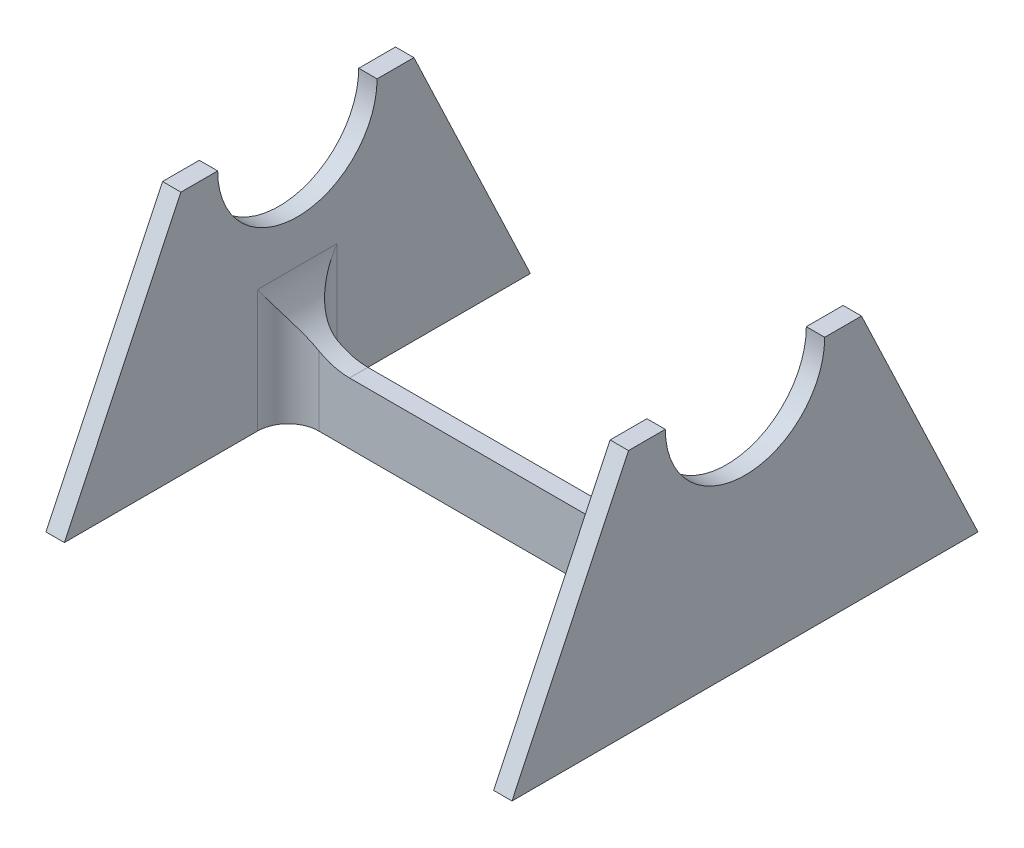
ISO-10303-21;
HEADER;
FILE_DESCRIPTION(('STEP AP214'),'2;1');
FILE_NAME('part.step','',(''),(''),'','','');
FILE_SCHEMA(('AUTOMOTIVE_DESIGN { 1 0 10303 214 1 1 1 1 }'));
ENDSEC;
DATA;
#1=APPLICATION_CONTEXT('core data for automotive mechanical design processes');
#2=APPLICATION_PROTOCOL_DEFINITION('international standard','automotive_design',2000,#1);
#3=PRODUCT_CONTEXT('',#1,'mechanical');
#4=PRODUCT('Part','Part','',(#3));
#5=PRODUCT_RELATED_PRODUCT_CATEGORY('part','',(#4));
#6=PRODUCT_DEFINITION_FORMATION('','',#4);
#7=PRODUCT_DEFINITION_CONTEXT('part definition',#1,'design');
#8=PRODUCT_DEFINITION('design','',#6,#7);
#9=PRODUCT_DEFINITION_SHAPE('','',#8);
#10=(LENGTH_UNIT() NAMED_UNIT(*) SI_UNIT(.MILLI.,.METRE.));
#11=(NAMED_UNIT(*) PLANE_ANGLE_UNIT() SI_UNIT($,.RADIAN.));
#12=(NAMED_UNIT(*) SI_UNIT($,.STERADIAN.) SOLID_ANGLE_UNIT());
#13=UNCERTAINTY_MEASURE_WITH_UNIT(LENGTH_MEASURE(1.E-05),#10,'distance_accuracy_value','');
#14=(GEOMETRIC_REPRESENTATION_CONTEXT(3) GLOBAL_UNCERTAINTY_ASSIGNED_CONTEXT((#13)) GLOBAL_UNIT_ASSIGNED_CONTEXT((#10,
#11,#12)) REPRESENTATION_CONTEXT('',''));
#15=CARTESIAN_POINT('',(0.,0.,0.));
#16=DIRECTION('',(0.,0.,1.));
#17=DIRECTION('',(1.,0.,0.));
#18=AXIS2_PLACEMENT_3D('',#15,#16,#17);
#19=CARTESIAN_POINT('',(-35.,-20.,3.));
#20=DIRECTION('',(0.,1.,0.));
#21=DIRECTION('',(0.,0.,1.));
#22=AXIS2_PLACEMENT_3D('',#19,#20,#21);
#23=PLANE('',#22);
#24=DIRECTION('',(0.,0.,-1.));
#25=VECTOR('',#24,1.);
#26=CARTESIAN_POINT('',(-35.,-20.,39.5));
#27=LINE('',#26,#25);
#28=CARTESIAN_POINT('',(-35.,-20.,-4.99999999999998));
#29=VERTEX_POINT('',#28);
#30=CARTESIAN_POINT('',(-35.,-20.,-36.5));
#31=VERTEX_POINT('',#30);
#32=EDGE_CURVE('E229',#29,#31,#27,.T.);
#33=ORIENTED_EDGE('',*,*,#32,.F.);
#34=CARTESIAN_POINT('',(-30.,-20.,-5.));
#35=DIRECTION('',(0.,1.,0.));
#36=DIRECTION('',(0.,0.,1.));
#37=AXIS2_PLACEMENT_3D('',#34,#35,#36);
#38=CIRCLE('',#37,5.);
#39=CARTESIAN_POINT('',(-30.,-20.,0.));
#40=VERTEX_POINT('',#39);
#41=EDGE_CURVE('E353',#29,#40,#38,.T.);
#42=ORIENTED_EDGE('',*,*,#41,.T.);
#43=DIRECTION('',(1.,0.,0.));
#44=VECTOR('',#43,1.);
#45=CARTESIAN_POINT('',(-35.,-20.,0.));
#46=LINE('',#45,#44);
#47=CARTESIAN_POINT('',(30.,-20.,0.));
#48=VERTEX_POINT('',#47);
#49=EDGE_CURVE('E284',#40,#48,#46,.T.);
#50=ORIENTED_EDGE('',*,*,#49,.T.);
#51=CARTESIAN_POINT('',(30.,-20.,-5.));
#52=DIRECTION('',(0.,1.,0.));
#53=DIRECTION('',(0.,0.,1.));
#54=AXIS2_PLACEMENT_3D('',#51,#52,#53);
#55=CIRCLE('',#54,5.);
#56=CARTESIAN_POINT('',(35.,-20.,-5.00000000000001));
#57=VERTEX_POINT('',#56);
#58=EDGE_CURVE('E316',#48,#57,#55,.T.);
#59=ORIENTED_EDGE('',*,*,#58,.T.);
#60=DIRECTION('',(0.,0.,-1.));
#61=VECTOR('',#60,1.);
#62=CARTESIAN_POINT('',(35.,-20.,-36.5));
#63=LINE('',#62,#61);
#64=CARTESIAN_POINT('',(35.,-20.,-36.5));
#65=VERTEX_POINT('',#64);
#66=EDGE_CURVE('E264',#57,#65,#63,.T.);
#67=ORIENTED_EDGE('',*,*,#66,.T.);
#68=DIRECTION('',(-1.,0.,0.));
#69=VECTOR('',#68,1.);
#70=CARTESIAN_POINT('',(38.,-20.,-36.5));
#71=LINE('',#70,#69);
#72=CARTESIAN_POINT('',(38.,-20.,-36.5));
#73=VERTEX_POINT('',#72);
#74=EDGE_CURVE('E683',#73,#65,#71,.T.);
#75=ORIENTED_EDGE('',*,*,#74,.F.);
#76=DIRECTION('',(0.,0.,-1.));
#77=VECTOR('',#76,1.);
#78=CARTESIAN_POINT('',(38.,-20.,39.5));
#79=LINE('',#78,#77);
#80=CARTESIAN_POINT('',(38.,-20.,39.5));
#81=VERTEX_POINT('',#80);
#82=EDGE_CURVE('E250',#81,#73,#79,.T.);
#83=ORIENTED_EDGE('',*,*,#82,.F.);
#84=DIRECTION('',(-1.,0.,0.));
#85=VECTOR('',#84,1.);
#86=CARTESIAN_POINT('',(38.,-20.,39.5));
#87=LINE('',#86,#85);
#88=CARTESIAN_POINT('',(35.,-20.,39.5));
#89=VERTEX_POINT('',#88);
#90=EDGE_CURVE('E677',#81,#89,#87,.T.);
#91=ORIENTED_EDGE('',*,*,#90,.T.);
#92=CARTESIAN_POINT('',(35.,-20.,7.99999999999999));
#93=VERTEX_POINT('',#92);
#94=EDGE_CURVE('E274',#89,#93,#63,.T.);
#95=ORIENTED_EDGE('',*,*,#94,.T.);
#96=CARTESIAN_POINT('',(30.,-20.,8.));
#97=DIRECTION('',(0.,1.,0.));
#98=DIRECTION('',(0.,0.,1.));
#99=AXIS2_PLACEMENT_3D('',#96,#97,#98);
#100=CIRCLE('',#99,5.);
#101=CARTESIAN_POINT('',(30.,-20.,3.));
#102=VERTEX_POINT('',#101);
#103=EDGE_CURVE('E11',#93,#102,#100,.T.);
#104=ORIENTED_EDGE('',*,*,#103,.T.);
#105=DIRECTION('',(1.,0.,0.));
#106=VECTOR('',#105,1.);
#107=CARTESIAN_POINT('',(-35.,-20.,3.));
#108=LINE('',#107,#106);
#109=CARTESIAN_POINT('',(-30.,-20.,3.));
#110=VERTEX_POINT('',#109);
#111=EDGE_CURVE('E259',#110,#102,#108,.T.);
#112=ORIENTED_EDGE('',*,*,#111,.F.);
#113=CARTESIAN_POINT('',(-30.,-20.,8.));
#114=DIRECTION('',(0.,1.,0.));
#115=DIRECTION('',(0.,0.,1.));
#116=AXIS2_PLACEMENT_3D('',#113,#114,#115);
#117=CIRCLE('',#116,5.);
#118=CARTESIAN_POINT('',(-35.,-20.,8.00000000000001));
#119=VERTEX_POINT('',#118);
#120=EDGE_CURVE('E55',#110,#119,#117,.T.);
#121=ORIENTED_EDGE('',*,*,#120,.T.);
#122=CARTESIAN_POINT('',(-35.,-20.,39.5));
#123=VERTEX_POINT('',#122);
#124=EDGE_CURVE('E239',#123,#119,#27,.T.);
#125=ORIENTED_EDGE('',*,*,#124,.F.);
#126=DIRECTION('',(1.,0.,0.));
#127=VECTOR('',#126,1.);
#128=CARTESIAN_POINT('',(-38.,-20.,39.5));
#129=LINE('',#128,#127);
#130=CARTESIAN_POINT('',(-38.,-20.,39.5));
#131=VERTEX_POINT('',#130);
#132=EDGE_CURVE('E397',#131,#123,#129,.T.);
#133=ORIENTED_EDGE('',*,*,#132,.F.);
#134=DIRECTION('',(0.,0.,-1.));
#135=VECTOR('',#134,1.);
#136=CARTESIAN_POINT('',(-38.,-20.,-36.5));
#137=LINE('',#136,#135);
#138=CARTESIAN_POINT('',(-38.,-20.,-36.5));
#139=VERTEX_POINT('',#138);
#140=EDGE_CURVE('E212',#131,#139,#137,.T.);
#141=ORIENTED_EDGE('',*,*,#140,.T.);
#142=DIRECTION('',(1.,0.,0.));
#143=VECTOR('',#142,1.);
#144=CARTESIAN_POINT('',(-38.,-20.,-36.5));
#145=LINE('',#144,#143);
#146=EDGE_CURVE('E399',#139,#31,#145,.T.);
#147=ORIENTED_EDGE('',*,*,#146,.T.);
#148=EDGE_LOOP('',(#33,#42,#50,#59,#67,#75,#83,#91,#95,#104,#112,#121,#125,#133,#141,#147));
#149=FACE_BOUND('',#148,.T.);
#150=ADVANCED_FACE('F33',(#149),#23,.F.);
#151=CARTESIAN_POINT('',(0.,0.,3.));
#152=DIRECTION('',(0.,0.,-1.));
#153=DIRECTION('',(-1.,0.,0.));
#154=AXIS2_PLACEMENT_3D('',#151,#152,#153);
#155=PLANE('',#154);
#156=CARTESIAN_POINT('',(-25.,0.,3.));
#157=DIRECTION('',(0.,0.,-1.));
#158=DIRECTION('',(-1.,0.,0.));
#159=AXIS2_PLACEMENT_3D('',#156,#157,#158);
#160=CIRCLE('',#159,10.);
#161=CARTESIAN_POINT('',(-25.,-9.99999999999999,3.));
#162=VERTEX_POINT('',#161);
#163=CARTESIAN_POINT('',(-30.,-8.66025403784438,3.));
#164=VERTEX_POINT('',#163);
#165=EDGE_CURVE('E377',#162,#164,#160,.T.);
#166=ORIENTED_EDGE('',*,*,#165,.T.);
#167=DIRECTION('',(0.,-1.,0.));
#168=VECTOR('',#167,1.);
#169=CARTESIAN_POINT('',(-30.,-20.,3.));
#170=LINE('',#169,#168);
#171=EDGE_CURVE('E307',#164,#110,#170,.T.);
#172=ORIENTED_EDGE('',*,*,#171,.T.);
#173=ORIENTED_EDGE('',*,*,#111,.T.);
#174=DIRECTION('',(0.,1.,0.));
#175=VECTOR('',#174,1.);
#176=CARTESIAN_POINT('',(30.,0.,3.));
#177=LINE('',#176,#175);
#178=CARTESIAN_POINT('',(30.,-8.66025403784439,3.));
#179=VERTEX_POINT('',#178);
#180=EDGE_CURVE('E301',#102,#179,#177,.T.);
#181=ORIENTED_EDGE('',*,*,#180,.T.);
#182=CARTESIAN_POINT('',(25.,0.,3.));
#183=DIRECTION('',(0.,0.,-1.));
#184=DIRECTION('',(-1.,0.,0.));
#185=AXIS2_PLACEMENT_3D('',#182,#183,#184);
#186=CIRCLE('',#185,10.);
#187=CARTESIAN_POINT('',(25.,-10.,3.));
#188=VERTEX_POINT('',#187);
#189=EDGE_CURVE('E370',#179,#188,#186,.T.);
#190=ORIENTED_EDGE('',*,*,#189,.T.);
#191=DIRECTION('',(1.,0.,0.));
#192=VECTOR('',#191,1.);
#193=CARTESIAN_POINT('',(-35.,-9.99999999999999,3.));
#194=LINE('',#193,#192);
#195=EDGE_CURVE('E421',#162,#188,#194,.T.);
#196=ORIENTED_EDGE('',*,*,#195,.F.);
#197=EDGE_LOOP('',(#166,#172,#173,#181,#190,#196));
#198=FACE_BOUND('',#197,.T.);
#199=ADVANCED_FACE('F420',(#198),#155,.F.);
#200=CARTESIAN_POINT('',(0.,0.,0.));
#201=DIRECTION('',(0.,0.,-1.));
#202=DIRECTION('',(-1.,0.,0.));
#203=AXIS2_PLACEMENT_3D('',#200,#201,#202);
#204=PLANE('',#203);
#205=CARTESIAN_POINT('',(25.,0.,0.));
#206=DIRECTION('',(0.,0.,-1.));
#207=DIRECTION('',(-1.,0.,0.));
#208=AXIS2_PLACEMENT_3D('',#205,#206,#207);
#209=CIRCLE('',#208,10.);
#210=CARTESIAN_POINT('',(25.,-10.,0.));
#211=VERTEX_POINT('',#210);
#212=CARTESIAN_POINT('',(30.,-8.66025403784439,0.));
#213=VERTEX_POINT('',#212);
#214=EDGE_CURVE('E368',#211,#213,#209,.F.);
#215=ORIENTED_EDGE('',*,*,#214,.T.);
#216=DIRECTION('',(0.,1.,0.));
#217=VECTOR('',#216,1.);
#218=CARTESIAN_POINT('',(30.,0.,0.));
#219=LINE('',#218,#217);
#220=EDGE_CURVE('E290',#213,#48,#219,.F.);
#221=ORIENTED_EDGE('',*,*,#220,.T.);
#222=ORIENTED_EDGE('',*,*,#49,.F.);
#223=DIRECTION('',(0.,-1.,0.));
#224=VECTOR('',#223,1.);
#225=CARTESIAN_POINT('',(-30.,0.,0.));
#226=LINE('',#225,#224);
#227=CARTESIAN_POINT('',(-30.,-8.66025403784438,0.));
#228=VERTEX_POINT('',#227);
#229=EDGE_CURVE('E289',#40,#228,#226,.F.);
#230=ORIENTED_EDGE('',*,*,#229,.T.);
#231=CARTESIAN_POINT('',(-25.,0.,0.));
#232=DIRECTION('',(0.,0.,-1.));
#233=DIRECTION('',(-1.,0.,0.));
#234=AXIS2_PLACEMENT_3D('',#231,#232,#233);
#235=CIRCLE('',#234,10.);
#236=CARTESIAN_POINT('',(-25.,-9.99999999999999,0.));
#237=VERTEX_POINT('',#236);
#238=EDGE_CURVE('E373',#228,#237,#235,.F.);
#239=ORIENTED_EDGE('',*,*,#238,.T.);
#240=DIRECTION('',(1.,0.,0.));
#241=VECTOR('',#240,1.);
#242=CARTESIAN_POINT('',(-35.,-9.99999999999999,0.));
#243=LINE('',#242,#241);
#244=EDGE_CURVE('E226',#237,#211,#243,.T.);
#245=ORIENTED_EDGE('',*,*,#244,.T.);
#246=EDGE_LOOP('',(#215,#221,#222,#230,#239,#245));
#247=FACE_BOUND('',#246,.T.);
#248=ADVANCED_FACE('F424',(#247),#204,.T.);
#249=CARTESIAN_POINT('',(35.,20.,1.5));
#250=DIRECTION('',(1.,0.,0.));
#251=DIRECTION('',(0.,0.,-1.));
#252=AXIS2_PLACEMENT_3D('',#249,#250,#251);
#253=PLANE('',#252);
#254=ORIENTED_EDGE('',*,*,#66,.F.);
#255=DIRECTION('',(0.,1.,0.));
#256=VECTOR('',#255,1.);
#257=CARTESIAN_POINT('',(35.,20.,-5.));
#258=LINE('',#257,#256);
#259=CARTESIAN_POINT('',(35.,0.,-5.));
#260=VERTEX_POINT('',#259);
#261=EDGE_CURVE('E288',#57,#260,#258,.T.);
#262=ORIENTED_EDGE('',*,*,#261,.T.);
#263=DIRECTION('',(0.,0.,1.));
#264=VECTOR('',#263,1.);
#265=CARTESIAN_POINT('',(35.,0.,3.));
#266=LINE('',#265,#264);
#267=CARTESIAN_POINT('',(35.,0.,8.));
#268=VERTEX_POINT('',#267);
#269=EDGE_CURVE('E380',#260,#268,#266,.T.);
#270=ORIENTED_EDGE('',*,*,#269,.T.);
#271=DIRECTION('',(0.,1.,0.));
#272=VECTOR('',#271,1.);
#273=CARTESIAN_POINT('',(35.,-20.,8.));
#274=LINE('',#273,#272);
#275=EDGE_CURVE('E367',#268,#93,#274,.F.);
#276=ORIENTED_EDGE('',*,*,#275,.T.);
#277=ORIENTED_EDGE('',*,*,#94,.F.);
#278=DIRECTION('',(0.,-0.90327750435429,0.429056814568288));
#279=VECTOR('',#278,1.);
#280=CARTESIAN_POINT('',(35.,20.,20.5));
#281=LINE('',#280,#279);
#282=CARTESIAN_POINT('',(35.,20.,20.5));
#283=VERTEX_POINT('',#282);
#284=EDGE_CURVE('E261',#283,#89,#281,.T.);
#285=ORIENTED_EDGE('',*,*,#284,.F.);
#286=DIRECTION('',(0.,0.,1.));
#287=VECTOR('',#286,1.);
#288=CARTESIAN_POINT('',(35.,20.,14.5));
#289=LINE('',#288,#287);
#290=CARTESIAN_POINT('',(35.,20.,14.5));
#291=VERTEX_POINT('',#290);
#292=EDGE_CURVE('E194',#291,#283,#289,.T.);
#293=ORIENTED_EDGE('',*,*,#292,.F.);
#294=CARTESIAN_POINT('',(35.,20.,1.5));
#295=DIRECTION('',(-1.,0.,0.));
#296=DIRECTION('',(0.,0.,1.));
#297=AXIS2_PLACEMENT_3D('',#294,#295,#296);
#298=CIRCLE('',#297,13.);
#299=CARTESIAN_POINT('',(35.,20.,-11.5));
#300=VERTEX_POINT('',#299);
#301=EDGE_CURVE('E257',#300,#291,#298,.T.);
#302=ORIENTED_EDGE('',*,*,#301,.F.);
#303=DIRECTION('',(0.,0.,1.));
#304=VECTOR('',#303,1.);
#305=CARTESIAN_POINT('',(35.,20.,-11.5));
#306=LINE('',#305,#304);
#307=CARTESIAN_POINT('',(35.,20.,-17.5));
#308=VERTEX_POINT('',#307);
#309=EDGE_CURVE('E246',#308,#300,#306,.T.);
#310=ORIENTED_EDGE('',*,*,#309,.F.);
#311=DIRECTION('',(0.,0.90327750435429,0.429056814568288));
#312=VECTOR('',#311,1.);
#313=CARTESIAN_POINT('',(35.,20.,-17.5));
#314=LINE('',#313,#312);
#315=EDGE_CURVE('E267',#65,#308,#314,.T.);
#316=ORIENTED_EDGE('',*,*,#315,.F.);
#317=EDGE_LOOP('',(#254,#262,#270,#276,#277,#285,#293,#302,#310,#316));
#318=FACE_BOUND('',#317,.T.);
#319=ADVANCED_FACE('F364',(#318),#253,.F.);
#320=CARTESIAN_POINT('',(38.,20.,1.5));
#321=DIRECTION('',(-1.,0.,0.));
#322=DIRECTION('',(0.,0.,1.));
#323=AXIS2_PLACEMENT_3D('',#320,#321,#322);
#324=CYLINDRICAL_SURFACE('',#323,13.);
#325=DIRECTION('',(-1.,0.,0.));
#326=VECTOR('',#325,1.);
#327=CARTESIAN_POINT('',(38.,20.,-11.5));
#328=LINE('',#327,#326);
#329=CARTESIAN_POINT('',(38.,20.,-11.5));
#330=VERTEX_POINT('',#329);
#331=EDGE_CURVE('E256',#330,#300,#328,.T.);
#332=ORIENTED_EDGE('',*,*,#331,.T.);
#333=ORIENTED_EDGE('',*,*,#301,.T.);
#334=DIRECTION('',(-1.,0.,0.));
#335=VECTOR('',#334,1.);
#336=CARTESIAN_POINT('',(38.,20.,14.5));
#337=LINE('',#336,#335);
#338=CARTESIAN_POINT('',(38.,20.,14.5));
#339=VERTEX_POINT('',#338);
#340=EDGE_CURVE('E277',#339,#291,#337,.T.);
#341=ORIENTED_EDGE('',*,*,#340,.F.);
#342=CARTESIAN_POINT('',(38.,20.,1.5));
#343=DIRECTION('',(-1.,0.,0.));
#344=DIRECTION('',(0.,0.,-1.));
#345=AXIS2_PLACEMENT_3D('',#342,#343,#344);
#346=CIRCLE('',#345,13.);
#347=EDGE_CURVE('E243',#330,#339,#346,.T.);
#348=ORIENTED_EDGE('',*,*,#347,.F.);
#349=EDGE_LOOP('',(#332,#333,#341,#348));
#350=FACE_BOUND('',#349,.T.);
#351=ADVANCED_FACE('F438',(#350),#324,.F.);
#352=CARTESIAN_POINT('',(38.,20.,14.5));
#353=DIRECTION('',(0.,-1.,0.));
#354=DIRECTION('',(0.,0.,-1.));
#355=AXIS2_PLACEMENT_3D('',#352,#353,#354);
#356=PLANE('',#355);
#357=ORIENTED_EDGE('',*,*,#292,.T.);
#358=DIRECTION('',(-1.,0.,0.));
#359=VECTOR('',#358,1.);
#360=CARTESIAN_POINT('',(38.,20.,20.5));
#361=LINE('',#360,#359);
#362=CARTESIAN_POINT('',(38.,20.,20.5));
#363=VERTEX_POINT('',#362);
#364=EDGE_CURVE('E673',#363,#283,#361,.T.);
#365=ORIENTED_EDGE('',*,*,#364,.F.);
#366=DIRECTION('',(0.,0.,1.));
#367=VECTOR('',#366,1.);
#368=CARTESIAN_POINT('',(38.,20.,14.5));
#369=LINE('',#368,#367);
#370=EDGE_CURVE('E245',#339,#363,#369,.T.);
#371=ORIENTED_EDGE('',*,*,#370,.F.);
#372=ORIENTED_EDGE('',*,*,#340,.T.);
#373=EDGE_LOOP('',(#357,#365,#371,#372));
#374=FACE_BOUND('',#373,.T.);
#375=ADVANCED_FACE('F441',(#374),#356,.F.);
#376=CARTESIAN_POINT('',(38.,20.,20.5));
#377=DIRECTION('',(0.,-0.429056814568288,-0.90327750435429));
#378=DIRECTION('',(0.,0.90327750435429,-0.429056814568288));
#379=AXIS2_PLACEMENT_3D('',#376,#377,#378);
#380=PLANE('',#379);
#381=ORIENTED_EDGE('',*,*,#284,.T.);
#382=ORIENTED_EDGE('',*,*,#90,.F.);
#383=DIRECTION('',(0.,-0.90327750435429,0.429056814568288));
#384=VECTOR('',#383,1.);
#385=CARTESIAN_POINT('',(38.,20.,20.5));
#386=LINE('',#385,#384);
#387=EDGE_CURVE('E248',#363,#81,#386,.T.);
#388=ORIENTED_EDGE('',*,*,#387,.F.);
#389=ORIENTED_EDGE('',*,*,#364,.T.);
#390=EDGE_LOOP('',(#381,#382,#388,#389));
#391=FACE_BOUND('',#390,.T.);
#392=ADVANCED_FACE('F445',(#391),#380,.F.);
#393=CARTESIAN_POINT('',(38.,20.,-17.5));
#394=DIRECTION('',(0.,-0.429056814568288,0.90327750435429));
#395=DIRECTION('',(0.,-0.90327750435429,-0.429056814568288));
#396=AXIS2_PLACEMENT_3D('',#393,#394,#395);
#397=PLANE('',#396);
#398=ORIENTED_EDGE('',*,*,#315,.T.);
#399=DIRECTION('',(-1.,0.,0.));
#400=VECTOR('',#399,1.);
#401=CARTESIAN_POINT('',(38.,20.,-17.5));
#402=LINE('',#401,#400);
#403=CARTESIAN_POINT('',(38.,20.,-17.5));
#404=VERTEX_POINT('',#403);
#405=EDGE_CURVE('E684',#404,#308,#402,.T.);
#406=ORIENTED_EDGE('',*,*,#405,.F.);
#407=DIRECTION('',(0.,0.90327750435429,0.429056814568288));
#408=VECTOR('',#407,1.);
#409=CARTESIAN_POINT('',(38.,20.,-17.5));
#410=LINE('',#409,#408);
#411=EDGE_CURVE('E252',#73,#404,#410,.T.);
#412=ORIENTED_EDGE('',*,*,#411,.F.);
#413=ORIENTED_EDGE('',*,*,#74,.T.);
#414=EDGE_LOOP('',(#398,#406,#412,#413));
#415=FACE_BOUND('',#414,.T.);
#416=ADVANCED_FACE('F449',(#415),#397,.F.);
#417=CARTESIAN_POINT('',(38.,20.,-11.5));
#418=DIRECTION('',(0.,-1.,0.));
#419=DIRECTION('',(0.,0.,-1.));
#420=AXIS2_PLACEMENT_3D('',#417,#418,#419);
#421=PLANE('',#420);
#422=ORIENTED_EDGE('',*,*,#309,.T.);
#423=ORIENTED_EDGE('',*,*,#331,.F.);
#424=DIRECTION('',(0.,0.,1.));
#425=VECTOR('',#424,1.);
#426=CARTESIAN_POINT('',(38.,20.,-11.5));
#427=LINE('',#426,#425);
#428=EDGE_CURVE('E254',#404,#330,#427,.T.);
#429=ORIENTED_EDGE('',*,*,#428,.F.);
#430=ORIENTED_EDGE('',*,*,#405,.T.);
#431=EDGE_LOOP('',(#422,#423,#429,#430));
#432=FACE_BOUND('',#431,.T.);
#433=ADVANCED_FACE('F453',(#432),#421,.F.);
#434=CARTESIAN_POINT('',(38.,20.,1.5));
#435=DIRECTION('',(1.,0.,0.));
#436=DIRECTION('',(0.,0.,-1.));
#437=AXIS2_PLACEMENT_3D('',#434,#435,#436);
#438=PLANE('',#437);
#439=ORIENTED_EDGE('',*,*,#347,.T.);
#440=ORIENTED_EDGE('',*,*,#370,.T.);
#441=ORIENTED_EDGE('',*,*,#387,.T.);
#442=ORIENTED_EDGE('',*,*,#82,.T.);
#443=ORIENTED_EDGE('',*,*,#411,.T.);
#444=ORIENTED_EDGE('',*,*,#428,.T.);
#445=EDGE_LOOP('',(#439,#440,#441,#442,#443,#444));
#446=FACE_BOUND('',#445,.T.);
#447=ADVANCED_FACE('F457',(#446),#438,.T.);
#448=CARTESIAN_POINT('',(-35.,20.,1.5));
#449=DIRECTION('',(-1.,0.,0.));
#450=DIRECTION('',(0.,0.,-1.));
#451=AXIS2_PLACEMENT_3D('',#448,#449,#450);
#452=PLANE('',#451);
#453=DIRECTION('',(0.,0.,1.));
#454=VECTOR('',#453,1.);
#455=CARTESIAN_POINT('',(-35.,0.,0.));
#456=LINE('',#455,#454);
#457=CARTESIAN_POINT('',(-35.,0.,8.));
#458=VERTEX_POINT('',#457);
#459=CARTESIAN_POINT('',(-35.,0.,-5.));
#460=VERTEX_POINT('',#459);
#461=EDGE_CURVE('E382',#458,#460,#456,.F.);
#462=ORIENTED_EDGE('',*,*,#461,.T.);
#463=DIRECTION('',(0.,-1.,0.));
#464=VECTOR('',#463,1.);
#465=CARTESIAN_POINT('',(-35.,20.,-5.));
#466=LINE('',#465,#464);
#467=EDGE_CURVE('E297',#460,#29,#466,.T.);
#468=ORIENTED_EDGE('',*,*,#467,.T.);
#469=ORIENTED_EDGE('',*,*,#32,.T.);
#470=DIRECTION('',(0.,0.90327750435429,0.429056814568288));
#471=VECTOR('',#470,1.);
#472=CARTESIAN_POINT('',(-35.,20.,-17.5));
#473=LINE('',#472,#471);
#474=CARTESIAN_POINT('',(-35.,20.,-17.5));
#475=VERTEX_POINT('',#474);
#476=EDGE_CURVE('E225',#31,#475,#473,.T.);
#477=ORIENTED_EDGE('',*,*,#476,.T.);
#478=DIRECTION('',(0.,0.,1.));
#479=VECTOR('',#478,1.);
#480=CARTESIAN_POINT('',(-35.,20.,-11.5));
#481=LINE('',#480,#479);
#482=CARTESIAN_POINT('',(-35.,20.,-11.5));
#483=VERTEX_POINT('',#482);
#484=EDGE_CURVE('E223',#475,#483,#481,.T.);
#485=ORIENTED_EDGE('',*,*,#484,.T.);
#486=CARTESIAN_POINT('',(-35.,20.,1.5));
#487=DIRECTION('',(-1.,0.,0.));
#488=DIRECTION('',(0.,0.,1.));
#489=AXIS2_PLACEMENT_3D('',#486,#487,#488);
#490=CIRCLE('',#489,13.);
#491=CARTESIAN_POINT('',(-35.,20.,14.5));
#492=VERTEX_POINT('',#491);
#493=EDGE_CURVE('E189',#483,#492,#490,.T.);
#494=ORIENTED_EDGE('',*,*,#493,.T.);
#495=DIRECTION('',(0.,0.,1.));
#496=VECTOR('',#495,1.);
#497=CARTESIAN_POINT('',(-35.,20.,14.5));
#498=LINE('',#497,#496);
#499=CARTESIAN_POINT('',(-35.,20.,20.5));
#500=VERTEX_POINT('',#499);
#501=EDGE_CURVE('E207',#492,#500,#498,.T.);
#502=ORIENTED_EDGE('',*,*,#501,.T.);
#503=DIRECTION('',(0.,-0.90327750435429,0.429056814568288));
#504=VECTOR('',#503,1.);
#505=CARTESIAN_POINT('',(-35.,20.,20.5));
#506=LINE('',#505,#504);
#507=EDGE_CURVE('E232',#500,#123,#506,.T.);
#508=ORIENTED_EDGE('',*,*,#507,.T.);
#509=ORIENTED_EDGE('',*,*,#124,.T.);
#510=DIRECTION('',(0.,-1.,0.));
#511=VECTOR('',#510,1.);
#512=CARTESIAN_POINT('',(-35.,0.,8.));
#513=LINE('',#512,#511);
#514=EDGE_CURVE('E291',#119,#458,#513,.F.);
#515=ORIENTED_EDGE('',*,*,#514,.T.);
#516=EDGE_LOOP('',(#462,#468,#469,#477,#485,#494,#502,#508,#509,#515));
#517=FACE_BOUND('',#516,.T.);
#518=ADVANCED_FACE('F404',(#517),#452,.F.);
#519=CARTESIAN_POINT('',(-38.,20.,-11.5));
#520=DIRECTION('',(0.,1.,0.));
#521=DIRECTION('',(0.,0.,1.));
#522=AXIS2_PLACEMENT_3D('',#519,#520,#521);
#523=PLANE('',#522);
#524=ORIENTED_EDGE('',*,*,#484,.F.);
#525=DIRECTION('',(1.,0.,0.));
#526=VECTOR('',#525,1.);
#527=CARTESIAN_POINT('',(-38.,20.,-17.5));
#528=LINE('',#527,#526);
#529=CARTESIAN_POINT('',(-38.,20.,-17.5));
#530=VERTEX_POINT('',#529);
#531=EDGE_CURVE('E195',#530,#475,#528,.T.);
#532=ORIENTED_EDGE('',*,*,#531,.F.);
#533=DIRECTION('',(0.,0.,1.));
#534=VECTOR('',#533,1.);
#535=CARTESIAN_POINT('',(-38.,20.,-11.5));
#536=LINE('',#535,#534);
#537=CARTESIAN_POINT('',(-38.,20.,-11.5));
#538=VERTEX_POINT('',#537);
#539=EDGE_CURVE('E202',#530,#538,#536,.T.);
#540=ORIENTED_EDGE('',*,*,#539,.T.);
#541=DIRECTION('',(1.,0.,0.));
#542=VECTOR('',#541,1.);
#543=CARTESIAN_POINT('',(-38.,20.,-11.5));
#544=LINE('',#543,#542);
#545=EDGE_CURVE('E183',#538,#483,#544,.T.);
#546=ORIENTED_EDGE('',*,*,#545,.T.);
#547=EDGE_LOOP('',(#524,#532,#540,#546));
#548=FACE_BOUND('',#547,.T.);
#549=ADVANCED_FACE('F209',(#548),#523,.T.);
#550=CARTESIAN_POINT('',(-38.,20.,-17.5));
#551=DIRECTION('',(0.,0.429056814568288,-0.90327750435429));
#552=DIRECTION('',(0.,0.90327750435429,0.429056814568288));
#553=AXIS2_PLACEMENT_3D('',#550,#551,#552);
#554=PLANE('',#553);
#555=ORIENTED_EDGE('',*,*,#476,.F.);
#556=ORIENTED_EDGE('',*,*,#146,.F.);
#557=DIRECTION('',(0.,0.90327750435429,0.429056814568288));
#558=VECTOR('',#557,1.);
#559=CARTESIAN_POINT('',(-38.,20.,-17.5));
#560=LINE('',#559,#558);
#561=EDGE_CURVE('E210',#139,#530,#560,.T.);
#562=ORIENTED_EDGE('',*,*,#561,.T.);
#563=ORIENTED_EDGE('',*,*,#531,.T.);
#564=EDGE_LOOP('',(#555,#556,#562,#563));
#565=FACE_BOUND('',#564,.T.);
#566=ADVANCED_FACE('F403',(#565),#554,.T.);
#567=CARTESIAN_POINT('',(-38.,20.,20.5));
#568=DIRECTION('',(0.,0.429056814568288,0.90327750435429));
#569=DIRECTION('',(0.,-0.90327750435429,0.429056814568288));
#570=AXIS2_PLACEMENT_3D('',#567,#568,#569);
#571=PLANE('',#570);
#572=ORIENTED_EDGE('',*,*,#507,.F.);
#573=DIRECTION('',(1.,0.,0.));
#574=VECTOR('',#573,1.);
#575=CARTESIAN_POINT('',(-38.,20.,20.5));
#576=LINE('',#575,#574);
#577=CARTESIAN_POINT('',(-38.,20.,20.5));
#578=VERTEX_POINT('',#577);
#579=EDGE_CURVE('E395',#578,#500,#576,.T.);
#580=ORIENTED_EDGE('',*,*,#579,.F.);
#581=DIRECTION('',(0.,-0.90327750435429,0.429056814568288));
#582=VECTOR('',#581,1.);
#583=CARTESIAN_POINT('',(-38.,20.,20.5));
#584=LINE('',#583,#582);
#585=EDGE_CURVE('E218',#578,#131,#584,.T.);
#586=ORIENTED_EDGE('',*,*,#585,.T.);
#587=ORIENTED_EDGE('',*,*,#132,.T.);
#588=EDGE_LOOP('',(#572,#580,#586,#587));
#589=FACE_BOUND('',#588,.T.);
#590=ADVANCED_FACE('F411',(#589),#571,.T.);
#591=CARTESIAN_POINT('',(-38.,20.,14.5));
#592=DIRECTION('',(0.,1.,0.));
#593=DIRECTION('',(0.,0.,1.));
#594=AXIS2_PLACEMENT_3D('',#591,#592,#593);
#595=PLANE('',#594);
#596=ORIENTED_EDGE('',*,*,#501,.F.);
#597=DIRECTION('',(1.,0.,0.));
#598=VECTOR('',#597,1.);
#599=CARTESIAN_POINT('',(-38.,20.,14.5));
#600=LINE('',#599,#598);
#601=CARTESIAN_POINT('',(-38.,20.,14.5));
#602=VERTEX_POINT('',#601);
#603=EDGE_CURVE('E222',#602,#492,#600,.T.);
#604=ORIENTED_EDGE('',*,*,#603,.F.);
#605=DIRECTION('',(0.,0.,1.));
#606=VECTOR('',#605,1.);
#607=CARTESIAN_POINT('',(-38.,20.,14.5));
#608=LINE('',#607,#606);
#609=EDGE_CURVE('E206',#602,#578,#608,.T.);
#610=ORIENTED_EDGE('',*,*,#609,.T.);
#611=ORIENTED_EDGE('',*,*,#579,.T.);
#612=EDGE_LOOP('',(#596,#604,#610,#611));
#613=FACE_BOUND('',#612,.T.);
#614=ADVANCED_FACE('F414',(#613),#595,.T.);
#615=CARTESIAN_POINT('',(-38.,20.,1.5));
#616=DIRECTION('',(1.,0.,0.));
#617=DIRECTION('',(0.,0.,-1.));
#618=AXIS2_PLACEMENT_3D('',#615,#616,#617);
#619=CYLINDRICAL_SURFACE('',#618,13.);
#620=ORIENTED_EDGE('',*,*,#493,.F.);
#621=ORIENTED_EDGE('',*,*,#545,.F.);
#622=CARTESIAN_POINT('',(-38.,20.,1.5));
#623=DIRECTION('',(-1.,0.,0.));
#624=DIRECTION('',(0.,0.,-1.));
#625=AXIS2_PLACEMENT_3D('',#622,#623,#624);
#626=CIRCLE('',#625,13.);
#627=EDGE_CURVE('E187',#538,#602,#626,.T.);
#628=ORIENTED_EDGE('',*,*,#627,.T.);
#629=ORIENTED_EDGE('',*,*,#603,.T.);
#630=EDGE_LOOP('',(#620,#621,#628,#629));
#631=FACE_BOUND('',#630,.T.);
#632=ADVANCED_FACE('F185',(#631),#619,.F.);
#633=CARTESIAN_POINT('',(-38.,20.,1.5));
#634=DIRECTION('',(-1.,0.,0.));
#635=DIRECTION('',(0.,0.,-1.));
#636=AXIS2_PLACEMENT_3D('',#633,#634,#635);
#637=PLANE('',#636);
#638=ORIENTED_EDGE('',*,*,#627,.F.);
#639=ORIENTED_EDGE('',*,*,#539,.F.);
#640=ORIENTED_EDGE('',*,*,#561,.F.);
#641=ORIENTED_EDGE('',*,*,#140,.F.);
#642=ORIENTED_EDGE('',*,*,#585,.F.);
#643=ORIENTED_EDGE('',*,*,#609,.F.);
#644=EDGE_LOOP('',(#638,#639,#640,#641,#642,#643));
#645=FACE_BOUND('',#644,.T.);
#646=ADVANCED_FACE('F200',(#645),#637,.T.);
#647=CARTESIAN_POINT('',(-35.,-9.99999999999999,0.));
#648=DIRECTION('',(0.,-1.,0.));
#649=DIRECTION('',(1.,0.,0.));
#650=AXIS2_PLACEMENT_3D('',#647,#648,#649);
#651=PLANE('',#650);
#652=ORIENTED_EDGE('',*,*,#244,.F.);
#653=DIRECTION('',(0.,0.,1.));
#654=VECTOR('',#653,1.);
#655=CARTESIAN_POINT('',(-25.,-9.99999999999999,3.));
#656=LINE('',#655,#654);
#657=EDGE_CURVE('E384',#237,#162,#656,.T.);
#658=ORIENTED_EDGE('',*,*,#657,.T.);
#659=ORIENTED_EDGE('',*,*,#195,.T.);
#660=DIRECTION('',(0.,0.,1.));
#661=VECTOR('',#660,1.);
#662=CARTESIAN_POINT('',(25.,-10.,0.));
#663=LINE('',#662,#661);
#664=EDGE_CURVE('E386',#188,#211,#663,.F.);
#665=ORIENTED_EDGE('',*,*,#664,.T.);
#666=EDGE_LOOP('',(#652,#658,#659,#665));
#667=FACE_BOUND('',#666,.T.);
#668=ADVANCED_FACE('F478',(#667),#651,.F.);
#669=CARTESIAN_POINT('',(-25.,0.,0.));
#670=DIRECTION('',(0.,0.,-1.));
#671=DIRECTION('',(-1.,0.,0.));
#672=AXIS2_PLACEMENT_3D('',#669,#670,#671);
#673=CYLINDRICAL_SURFACE('',#672,10.);
#674=ORIENTED_EDGE('',*,*,#238,.F.);
#675=CARTESIAN_POINT('',(-30.,-8.66025403784438,0.));
#676=CARTESIAN_POINT('',(-30.0936098039848,-8.6062120074578,-2.82900777594433E-07));
#677=CARTESIAN_POINT('',(-30.1863112644491,-8.55066295495205,-0.00262887455136229));
#678=CARTESIAN_POINT('',(-30.3696413860299,-8.43674013232139,-0.0128372529330034));
#679=CARTESIAN_POINT('',(-30.4602707611627,-8.37836735749915,-0.0204153066888347));
#680=CARTESIAN_POINT('',(-30.7282724403887,-8.19956698087093,-0.0500643550123116));
#681=CARTESIAN_POINT('',(-30.9022749609317,-8.07515854387194,-0.0790536521328443));
#682=CARTESIAN_POINT('',(-31.2375074983312,-7.81904443475575,-0.152561857671347));
#683=CARTESIAN_POINT('',(-31.3988761663679,-7.68745724550812,-0.196869981539897));
#684=CARTESIAN_POINT('',(-31.7108067987731,-7.41672140086481,-0.298927164585155));
#685=CARTESIAN_POINT('',(-31.8613607052986,-7.27756724037253,-0.356686112509034));
#686=CARTESIAN_POINT('',(-32.1787769966391,-6.96588828465629,-0.495735220903305));
#687=CARTESIAN_POINT('',(-32.3432986936849,-6.79204858687787,-0.57941137953574));
#688=CARTESIAN_POINT('',(-32.6563187489263,-6.43714173518511,-0.760113724235781));
#689=CARTESIAN_POINT('',(-32.8048167641364,-6.25607442667792,-0.857140195964708));
#690=CARTESIAN_POINT('',(-33.0868459912028,-5.88703294153519,-1.06274155527058));
#691=CARTESIAN_POINT('',(-33.2202885435333,-5.69902570942699,-1.17137818980305));
#692=CARTESIAN_POINT('',(-33.4716706657225,-5.31816530131017,-1.39776170220442));
#693=CARTESIAN_POINT('',(-33.5896056915502,-5.12531072455858,-1.51551123435892));
#694=CARTESIAN_POINT('',(-33.8551586322553,-4.65673593818288,-1.80766922049535));
#695=CARTESIAN_POINT('',(-33.9954410395129,-4.379102363274,-1.98570315103981));
#696=CARTESIAN_POINT('',(-34.247514860227,-3.81812644181182,-2.35270007359216));
#697=CARTESIAN_POINT('',(-34.3592934869401,-3.53478159447695,-2.54166792406384));
#698=CARTESIAN_POINT('',(-34.5552412924628,-2.96447792559752,-2.92720972137606));
#699=CARTESIAN_POINT('',(-34.6394518022138,-2.67752519009298,-3.12377178346145));
#700=CARTESIAN_POINT('',(-34.7813060533288,-2.10098549177678,-3.52222740575507));
#701=CARTESIAN_POINT('',(-34.8389612332895,-1.81139971805271,-3.72411863075129));
#702=CARTESIAN_POINT('',(-34.9221379454986,-1.27090816212004,-4.10291579740566));
#703=CARTESIAN_POINT('',(-34.9510085495314,-1.02021175129122,-4.27940080098627));
#704=CARTESIAN_POINT('',(-34.9897179572053,-0.518432616012241,-4.63342093770752));
#705=CARTESIAN_POINT('',(-34.9995768157015,-0.267350578561548,-4.8109547658964));
#706=CARTESIAN_POINT('',(-34.9999955542052,-0.010886592106831,-4.99230201707911));
#707=CARTESIAN_POINT('',(-34.9999999985291,-0.00544327964939771,-4.99615102023732));
#708=CARTESIAN_POINT('',(-35.,0.,-5.));
#709=B_SPLINE_CURVE_WITH_KNOTS('',3,(#675,#676,#677,#678,#679,#680,#681,#682,#683,#684,#685,
#686,#687,#688,#689,#690,#691,#692,#693,#694,#695,#696,#697,#698,#699,#700,#701,#702,#703,#704,
#705,#706,#707,#708),.UNSPECIFIED.,.F.,.F.,(4,2,2,2,2,2,2,2,2,2,2,2,2,2,2,2,4),(0.,
0.324164501699152,0.648215563169972,1.29453690515217,1.93229735394221,2.57052815854178,
3.33008992767271,4.08966795194079,4.85350822338371,5.61757181965429,6.69122947966726,
7.76536793656894,8.83788855857111,9.90994676377595,10.8332249647611,11.7555286965104,
11.7755287009549),.UNSPECIFIED.);
#710=EDGE_CURVE('E348',#228,#460,#709,.T.);
#711=ORIENTED_EDGE('',*,*,#710,.T.);
#712=ORIENTED_EDGE('',*,*,#461,.F.);
#713=CARTESIAN_POINT('',(-30.,-8.66025403784438,3.));
#714=CARTESIAN_POINT('',(-30.0936098039848,-8.6062120074578,3.00000028290078));
#715=CARTESIAN_POINT('',(-30.1863112644491,-8.55066295495205,3.00262887455136));
#716=CARTESIAN_POINT('',(-30.3696413860299,-8.43674013232139,3.012837252933));
#717=CARTESIAN_POINT('',(-30.4602707611627,-8.37836735749915,3.02041530668884));
#718=CARTESIAN_POINT('',(-30.7282724403887,-8.19956698087093,3.05006435501231));
#719=CARTESIAN_POINT('',(-30.9022749609317,-8.07515854387194,3.07905365213285));
#720=CARTESIAN_POINT('',(-31.2375074983312,-7.81904443475575,3.15256185767135));
#721=CARTESIAN_POINT('',(-31.3988761663679,-7.68745724550812,3.1968699815399));
#722=CARTESIAN_POINT('',(-31.7108067987731,-7.41672140086481,3.29892716458516));
#723=CARTESIAN_POINT('',(-31.8613607052986,-7.27756724037253,3.35668611250903));
#724=CARTESIAN_POINT('',(-32.1787769966391,-6.96588828465629,3.4957352209033));
#725=CARTESIAN_POINT('',(-32.3432986936849,-6.79204858687787,3.57941137953574));
#726=CARTESIAN_POINT('',(-32.6563187489263,-6.43714173518511,3.76011372423578));
#727=CARTESIAN_POINT('',(-32.8048167641364,-6.25607442667792,3.85714019596471));
#728=CARTESIAN_POINT('',(-33.0868459912028,-5.8870329415352,4.06274155527058));
#729=CARTESIAN_POINT('',(-33.2202885435333,-5.69902570942699,4.17137818980305));
#730=CARTESIAN_POINT('',(-33.4716706657225,-5.31816530131017,4.39776170220442));
#731=CARTESIAN_POINT('',(-33.5896056915502,-5.12531072455858,4.51551123435892));
#732=CARTESIAN_POINT('',(-33.8551586322553,-4.65673593818288,4.80766922049535));
#733=CARTESIAN_POINT('',(-33.9954410395129,-4.379102363274,4.98570315103981));
#734=CARTESIAN_POINT('',(-34.247514860227,-3.81812644181181,5.35270007359216));
#735=CARTESIAN_POINT('',(-34.3592934869401,-3.53478159447695,5.54166792406384));
#736=CARTESIAN_POINT('',(-34.5552412924628,-2.96447792559752,5.92720972137606));
#737=CARTESIAN_POINT('',(-34.6394518022138,-2.67752519009297,6.12377178346145));
#738=CARTESIAN_POINT('',(-34.7813060533288,-2.10098549177678,6.52222740575507));
#739=CARTESIAN_POINT('',(-34.8389612332895,-1.81139971805272,6.7241186307513));
#740=CARTESIAN_POINT('',(-34.9221379454986,-1.27090816212004,7.10291579740565));
#741=CARTESIAN_POINT('',(-34.9510085495314,-1.02021175129121,7.27940080098624));
#742=CARTESIAN_POINT('',(-34.9897179572053,-0.518432616012245,7.63342093770752));
#743=CARTESIAN_POINT('',(-34.9995768157015,-0.267350578561583,7.81095476589645));
#744=CARTESIAN_POINT('',(-34.9999955542052,-0.0108865921068322,7.99230201707911));
#745=CARTESIAN_POINT('',(-34.9999999985291,-0.00544327964939829,7.99615102023732));
#746=CARTESIAN_POINT('',(-35.,0.,8.));
#747=B_SPLINE_CURVE_WITH_KNOTS('',3,(#713,#714,#715,#716,#717,#718,#719,#720,#721,#722,#723,
#724,#725,#726,#727,#728,#729,#730,#731,#732,#733,#734,#735,#736,#737,#738,#739,#740,#741,#742,
#743,#744,#745,#746),.UNSPECIFIED.,.F.,.F.,(4,2,2,2,2,2,2,2,2,2,2,2,2,2,2,2,4),(0.,
0.324164501699152,0.648215563169972,1.29453690515217,1.93229735394221,2.57052815854178,
3.33008992767271,4.08966795194079,4.85350822338371,5.61757181965429,6.69122947966726,
7.76536793656895,8.83788855857111,9.90994676377595,10.8332249647611,11.7555286965104,
11.7755287009549),.UNSPECIFIED.);
#748=EDGE_CURVE('E335',#458,#164,#747,.F.);
#749=ORIENTED_EDGE('',*,*,#748,.T.);
#750=ORIENTED_EDGE('',*,*,#165,.F.);
#751=ORIENTED_EDGE('',*,*,#657,.F.);
#752=EDGE_LOOP('',(#674,#711,#712,#749,#750,#751));
#753=FACE_BOUND('',#752,.T.);
#754=ADVANCED_FACE('F325',(#753),#673,.F.);
#755=CARTESIAN_POINT('',(25.,0.,1.5));
#756=DIRECTION('',(0.,0.,-1.));
#757=DIRECTION('',(-1.,0.,0.));
#758=AXIS2_PLACEMENT_3D('',#755,#756,#757);
#759=CYLINDRICAL_SURFACE('',#758,10.);
#760=ORIENTED_EDGE('',*,*,#214,.F.);
#761=ORIENTED_EDGE('',*,*,#664,.F.);
#762=ORIENTED_EDGE('',*,*,#189,.F.);
#763=CARTESIAN_POINT('',(30.,-8.66025403784439,3.));
#764=CARTESIAN_POINT('',(30.0936098039848,-8.6062120074578,3.00000028290078));
#765=CARTESIAN_POINT('',(30.1863112644491,-8.55066295495206,3.00262887455136));
#766=CARTESIAN_POINT('',(30.3696413860299,-8.43674013232139,3.012837252933));
#767=CARTESIAN_POINT('',(30.4602707611627,-8.37836735749915,3.02041530668883));
#768=CARTESIAN_POINT('',(30.7282724403887,-8.19956698087094,3.05006435501231));
#769=CARTESIAN_POINT('',(30.9022749609317,-8.07515854387195,3.07905365213284));
#770=CARTESIAN_POINT('',(31.2375074983312,-7.81904443475575,3.15256185767135));
#771=CARTESIAN_POINT('',(31.3988761663679,-7.68745724550813,3.1968699815399));
#772=CARTESIAN_POINT('',(31.7108067987731,-7.41672140086481,3.29892716458516));
#773=CARTESIAN_POINT('',(31.8613607052986,-7.27756724037254,3.35668611250903));
#774=CARTESIAN_POINT('',(32.1787769966391,-6.9658882846563,3.4957352209033));
#775=CARTESIAN_POINT('',(32.3432986936849,-6.79204858687787,3.57941137953574));
#776=CARTESIAN_POINT('',(32.6563187489263,-6.43714173518511,3.76011372423578));
#777=CARTESIAN_POINT('',(32.8048167641364,-6.25607442667792,3.85714019596471));
#778=CARTESIAN_POINT('',(33.0868459912028,-5.88703294153519,4.06274155527058));
#779=CARTESIAN_POINT('',(33.2202885435333,-5.69902570942699,4.17137818980305));
#780=CARTESIAN_POINT('',(33.4716706657225,-5.31816530131017,4.39776170220442));
#781=CARTESIAN_POINT('',(33.5896056915502,-5.12531072455858,4.51551123435892));
#782=CARTESIAN_POINT('',(33.8551586322553,-4.65673593818289,4.80766922049535));
#783=CARTESIAN_POINT('',(33.9954410395129,-4.379102363274,4.98570315103981));
#784=CARTESIAN_POINT('',(34.247514860227,-3.81812644181182,5.35270007359216));
#785=CARTESIAN_POINT('',(34.3592934869401,-3.53478159447696,5.54166792406384));
#786=CARTESIAN_POINT('',(34.5552412924628,-2.96447792559752,5.92720972137606));
#787=CARTESIAN_POINT('',(34.6394518022138,-2.67752519009298,6.12377178346145));
#788=CARTESIAN_POINT('',(34.7813060533288,-2.10098549177679,6.52222740575507));
#789=CARTESIAN_POINT('',(34.8389612332895,-1.81139971805271,6.72411863075128));
#790=CARTESIAN_POINT('',(34.9221379454986,-1.27090816212005,7.10291579740566));
#791=CARTESIAN_POINT('',(34.9510085495314,-1.02021175129123,7.27940080098627));
#792=CARTESIAN_POINT('',(34.9897179572053,-0.518432616012241,7.63342093770751));
#793=CARTESIAN_POINT('',(34.9995768157015,-0.267350578561535,7.81095476589637));
#794=CARTESIAN_POINT('',(34.9999955542052,-0.0108865921068349,7.99230201707911));
#795=CARTESIAN_POINT('',(34.9999999985291,-0.00544327964940199,7.99615102023732));
#796=CARTESIAN_POINT('',(35.,0.,8.));
#797=B_SPLINE_CURVE_WITH_KNOTS('',3,(#763,#764,#765,#766,#767,#768,#769,#770,#771,#772,#773,
#774,#775,#776,#777,#778,#779,#780,#781,#782,#783,#784,#785,#786,#787,#788,#789,#790,#791,#792,
#793,#794,#795,#796),.UNSPECIFIED.,.F.,.F.,(4,2,2,2,2,2,2,2,2,2,2,2,2,2,2,2,4),(0.,
0.324164501699152,0.648215563169972,1.29453690515217,1.93229735394221,2.57052815854178,
3.33008992767271,4.08966795194079,4.85350822338372,5.61757181965429,6.69122947966725,
7.76536793656894,8.83788855857111,9.90994676377595,10.8332249647611,11.7555286965104,
11.7755287009549),.UNSPECIFIED.);
#798=EDGE_CURVE('E42',#179,#268,#797,.T.);
#799=ORIENTED_EDGE('',*,*,#798,.T.);
#800=ORIENTED_EDGE('',*,*,#269,.F.);
#801=CARTESIAN_POINT('',(30.,-8.66025403784439,0.));
#802=CARTESIAN_POINT('',(30.0936098039848,-8.6062120074578,-2.82900777597433E-07));
#803=CARTESIAN_POINT('',(30.1863112644491,-8.55066295495206,-0.00262887455136226));
#804=CARTESIAN_POINT('',(30.3696413860299,-8.43674013232139,-0.0128372529330033));
#805=CARTESIAN_POINT('',(30.4602707611627,-8.37836735749915,-0.0204153066888346));
#806=CARTESIAN_POINT('',(30.7282724403887,-8.19956698087094,-0.0500643550123115));
#807=CARTESIAN_POINT('',(30.9022749609317,-8.07515854387195,-0.0790536521328443));
#808=CARTESIAN_POINT('',(31.2375074983312,-7.81904443475575,-0.152561857671348));
#809=CARTESIAN_POINT('',(31.3988761663679,-7.68745724550813,-0.196869981539897));
#810=CARTESIAN_POINT('',(31.7108067987731,-7.41672140086481,-0.298927164585156));
#811=CARTESIAN_POINT('',(31.8613607052986,-7.27756724037254,-0.356686112509034));
#812=CARTESIAN_POINT('',(32.1787769966391,-6.9658882846563,-0.495735220903304));
#813=CARTESIAN_POINT('',(32.3432986936849,-6.79204858687787,-0.57941137953574));
#814=CARTESIAN_POINT('',(32.6563187489263,-6.43714173518511,-0.760113724235783));
#815=CARTESIAN_POINT('',(32.8048167641364,-6.25607442667792,-0.85714019596471));
#816=CARTESIAN_POINT('',(33.0868459912028,-5.88703294153519,-1.06274155527058));
#817=CARTESIAN_POINT('',(33.2202885435333,-5.69902570942699,-1.17137818980305));
#818=CARTESIAN_POINT('',(33.4716706657225,-5.31816530131017,-1.39776170220442));
#819=CARTESIAN_POINT('',(33.5896056915502,-5.12531072455858,-1.51551123435892));
#820=CARTESIAN_POINT('',(33.8551586322553,-4.65673593818289,-1.80766922049535));
#821=CARTESIAN_POINT('',(33.9954410395129,-4.379102363274,-1.98570315103981));
#822=CARTESIAN_POINT('',(34.247514860227,-3.81812644181182,-2.35270007359216));
#823=CARTESIAN_POINT('',(34.3592934869401,-3.53478159447696,-2.54166792406384));
#824=CARTESIAN_POINT('',(34.5552412924628,-2.96447792559753,-2.92720972137606));
#825=CARTESIAN_POINT('',(34.6394518022138,-2.67752519009298,-3.12377178346145));
#826=CARTESIAN_POINT('',(34.7813060533288,-2.10098549177679,-3.52222740575507));
#827=CARTESIAN_POINT('',(34.8389612332895,-1.81139971805272,-3.72411863075129));
#828=CARTESIAN_POINT('',(34.9221379454986,-1.27090816212005,-4.10291579740565));
#829=CARTESIAN_POINT('',(34.9510085495314,-1.02021175129122,-4.27940080098625));
#830=CARTESIAN_POINT('',(34.9897179572053,-0.518432616012253,-4.63342093770753));
#831=CARTESIAN_POINT('',(34.9995768157015,-0.267350578561576,-4.81095476589643));
#832=CARTESIAN_POINT('',(34.9999955542052,-0.0108865921068361,-4.99230201707911));
#833=CARTESIAN_POINT('',(34.9999999985291,-0.0054432796494026,-4.99615102023732));
#834=CARTESIAN_POINT('',(35.,0.,-5.));
#835=B_SPLINE_CURVE_WITH_KNOTS('',3,(#801,#802,#803,#804,#805,#806,#807,#808,#809,#810,#811,
#812,#813,#814,#815,#816,#817,#818,#819,#820,#821,#822,#823,#824,#825,#826,#827,#828,#829,#830,
#831,#832,#833,#834),.UNSPECIFIED.,.F.,.F.,(4,2,2,2,2,2,2,2,2,2,2,2,2,2,2,2,4),(0.,
0.324164501699152,0.648215563169972,1.29453690515217,1.93229735394221,2.57052815854178,
3.33008992767271,4.08966795194079,4.85350822338372,5.61757181965429,6.69122947966725,
7.76536793656894,8.83788855857111,9.90994676377595,10.8332249647611,11.7555286965104,
11.7755287009549),.UNSPECIFIED.);
#836=EDGE_CURVE('E309',#260,#213,#835,.F.);
#837=ORIENTED_EDGE('',*,*,#836,.T.);
#838=EDGE_LOOP('',(#760,#761,#762,#799,#800,#837));
#839=FACE_BOUND('',#838,.T.);
#840=ADVANCED_FACE('F321',(#839),#759,.F.);
#841=CARTESIAN_POINT('',(30.,20.,-5.));
#842=DIRECTION('',(0.,1.,0.));
#843=DIRECTION('',(0.,0.,1.));
#844=AXIS2_PLACEMENT_3D('',#841,#842,#843);
#845=CYLINDRICAL_SURFACE('',#844,5.);
#846=ORIENTED_EDGE('',*,*,#58,.F.);
#847=ORIENTED_EDGE('',*,*,#220,.F.);
#848=ORIENTED_EDGE('',*,*,#836,.F.);
#849=ORIENTED_EDGE('',*,*,#261,.F.);
#850=EDGE_LOOP('',(#846,#847,#848,#849));
#851=FACE_BOUND('',#850,.T.);
#852=ADVANCED_FACE('F318',(#851),#845,.F.);
#853=CARTESIAN_POINT('',(-30.,20.,-5.));
#854=DIRECTION('',(0.,-1.,0.));
#855=DIRECTION('',(0.,0.,-1.));
#856=AXIS2_PLACEMENT_3D('',#853,#854,#855);
#857=CYLINDRICAL_SURFACE('',#856,5.);
#858=ORIENTED_EDGE('',*,*,#710,.F.);
#859=ORIENTED_EDGE('',*,*,#229,.F.);
#860=ORIENTED_EDGE('',*,*,#41,.F.);
#861=ORIENTED_EDGE('',*,*,#467,.F.);
#862=EDGE_LOOP('',(#858,#859,#860,#861));
#863=FACE_BOUND('',#862,.T.);
#864=ADVANCED_FACE('F344',(#863),#857,.F.);
#865=CARTESIAN_POINT('',(-30.,0.,8.));
#866=DIRECTION('',(0.,1.,0.));
#867=DIRECTION('',(0.,0.,1.));
#868=AXIS2_PLACEMENT_3D('',#865,#866,#867);
#869=CYLINDRICAL_SURFACE('',#868,5.);
#870=ORIENTED_EDGE('',*,*,#748,.F.);
#871=ORIENTED_EDGE('',*,*,#514,.F.);
#872=ORIENTED_EDGE('',*,*,#120,.F.);
#873=ORIENTED_EDGE('',*,*,#171,.F.);
#874=EDGE_LOOP('',(#870,#871,#872,#873));
#875=FACE_BOUND('',#874,.T.);
#876=ADVANCED_FACE('F341',(#875),#869,.F.);
#877=CARTESIAN_POINT('',(30.,0.,8.));
#878=DIRECTION('',(0.,-1.,0.));
#879=DIRECTION('',(0.,0.,-1.));
#880=AXIS2_PLACEMENT_3D('',#877,#878,#879);
#881=CYLINDRICAL_SURFACE('',#880,5.);
#882=ORIENTED_EDGE('',*,*,#103,.F.);
#883=ORIENTED_EDGE('',*,*,#275,.F.);
#884=ORIENTED_EDGE('',*,*,#798,.F.);
#885=ORIENTED_EDGE('',*,*,#180,.F.);
#886=EDGE_LOOP('',(#882,#883,#884,#885));
#887=FACE_BOUND('',#886,.T.);
#888=ADVANCED_FACE('F35',(#887),#881,.F.);
#889=CLOSED_SHELL('',(#150,#199,#248,#319,#351,#375,#392,#416,#433,#447,#518,#549,#566,#590,
#614,#632,#646,#668,#754,#840,#852,#864,#876,#888));
#890=MANIFOLD_SOLID_BREP('B2',#889);
#891=ADVANCED_BREP_SHAPE_REPRESENTATION('',(#18,#890),#14);
#892=SHAPE_DEFINITION_REPRESENTATION(#9,#891);
ENDSEC;
END-ISO-10303-21;
